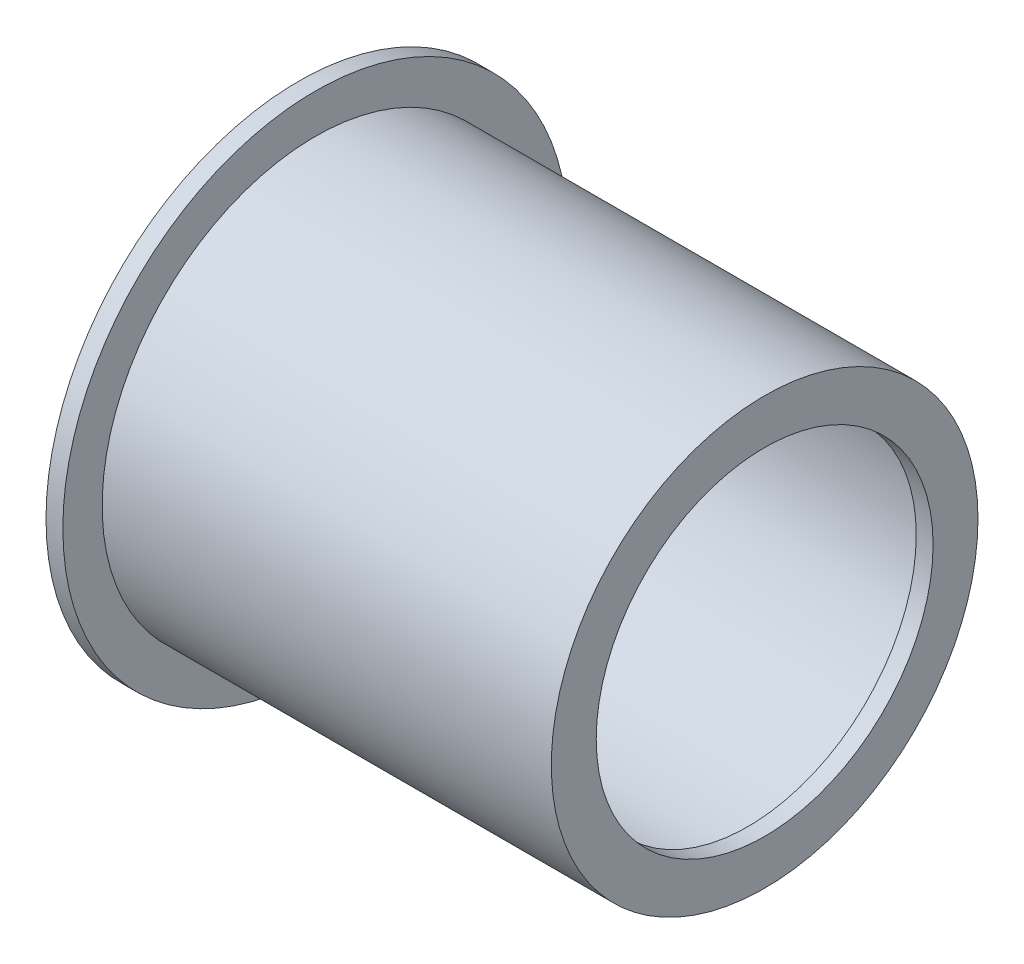
ISO-10303-21;
HEADER;
FILE_DESCRIPTION(('STEP AP214'),'2;1');
FILE_NAME('part.step','',(''),(''),'','','');
FILE_SCHEMA(('AUTOMOTIVE_DESIGN { 1 0 10303 214 1 1 1 1 }'));
ENDSEC;
DATA;
#1=APPLICATION_CONTEXT('core data for automotive mechanical design processes');
#2=APPLICATION_PROTOCOL_DEFINITION('international standard','automotive_design',2000,#1);
#3=PRODUCT_CONTEXT('',#1,'mechanical');
#4=PRODUCT('Part','Part','',(#3));
#5=PRODUCT_RELATED_PRODUCT_CATEGORY('part','',(#4));
#6=PRODUCT_DEFINITION_FORMATION('','',#4);
#7=PRODUCT_DEFINITION_CONTEXT('part definition',#1,'design');
#8=PRODUCT_DEFINITION('design','',#6,#7);
#9=PRODUCT_DEFINITION_SHAPE('','',#8);
#10=(LENGTH_UNIT() NAMED_UNIT(*) SI_UNIT(.MILLI.,.METRE.));
#11=(NAMED_UNIT(*) PLANE_ANGLE_UNIT() SI_UNIT($,.RADIAN.));
#12=(NAMED_UNIT(*) SI_UNIT($,.STERADIAN.) SOLID_ANGLE_UNIT());
#13=UNCERTAINTY_MEASURE_WITH_UNIT(LENGTH_MEASURE(1.E-05),#10,'distance_accuracy_value','');
#14=(GEOMETRIC_REPRESENTATION_CONTEXT(3) GLOBAL_UNCERTAINTY_ASSIGNED_CONTEXT((#13)) GLOBAL_UNIT_ASSIGNED_CONTEXT((#10,
#11,#12)) REPRESENTATION_CONTEXT('',''));
#15=CARTESIAN_POINT('',(0.,0.,0.));
#16=DIRECTION('',(0.,0.,1.));
#17=DIRECTION('',(1.,0.,0.));
#18=AXIS2_PLACEMENT_3D('',#15,#16,#17);
#19=CARTESIAN_POINT('',(0.,0.,0.));
#20=DIRECTION('',(1.,0.,0.));
#21=DIRECTION('',(0.,0.,-1.));
#22=AXIS2_PLACEMENT_3D('',#19,#20,#21);
#23=CYLINDRICAL_SURFACE('',#22,35.);
#24=CARTESIAN_POINT('',(0.,0.,0.));
#25=DIRECTION('',(1.,0.,0.));
#26=DIRECTION('',(0.,0.,-1.));
#27=AXIS2_PLACEMENT_3D('',#24,#25,#26);
#28=CIRCLE('',#27,35.);
#29=CARTESIAN_POINT('',(0.,0.,-35.));
#30=VERTEX_POINT('',#29);
#31=EDGE_CURVE('E10',#30,#30,#28,.T.);
#32=ORIENTED_EDGE('',*,*,#31,.T.);
#33=EDGE_LOOP('',(#32));
#34=FACE_BOUND('',#33,.T.);
#35=CARTESIAN_POINT('',(-77.,0.,0.));
#36=DIRECTION('',(-1.,0.,0.));
#37=DIRECTION('',(0.,0.,1.));
#38=AXIS2_PLACEMENT_3D('',#35,#36,#37);
#39=CIRCLE('',#38,35.);
#40=CARTESIAN_POINT('',(-77.,0.,35.));
#41=VERTEX_POINT('',#40);
#42=EDGE_CURVE('E61',#41,#41,#39,.T.);
#43=ORIENTED_EDGE('',*,*,#42,.T.);
#44=EDGE_LOOP('',(#43));
#45=FACE_BOUND('',#44,.T.);
#46=ADVANCED_FACE('F32',(#34,#45),#23,.F.);
#47=CARTESIAN_POINT('',(0.,35.,0.));
#48=DIRECTION('',(-1.,0.,0.));
#49=DIRECTION('',(0.,0.,1.));
#50=AXIS2_PLACEMENT_3D('',#47,#48,#49);
#51=PLANE('',#50);
#52=CARTESIAN_POINT('',(0.,0.,0.));
#53=DIRECTION('',(1.,0.,0.));
#54=DIRECTION('',(0.,0.,-1.));
#55=AXIS2_PLACEMENT_3D('',#52,#53,#54);
#56=CIRCLE('',#55,30.);
#57=CARTESIAN_POINT('',(0.,0.,-30.));
#58=VERTEX_POINT('',#57);
#59=EDGE_CURVE('E58',#58,#58,#56,.T.);
#60=ORIENTED_EDGE('',*,*,#59,.T.);
#61=EDGE_LOOP('',(#60));
#62=FACE_BOUND('',#61,.T.);
#63=ORIENTED_EDGE('',*,*,#31,.F.);
#64=EDGE_LOOP('',(#63));
#65=FACE_BOUND('',#64,.T.);
#66=ADVANCED_FACE('F34',(#62,#65),#51,.T.);
#67=CARTESIAN_POINT('',(-80.,45.,0.));
#68=DIRECTION('',(-1.,0.,0.));
#69=DIRECTION('',(0.,0.,1.));
#70=AXIS2_PLACEMENT_3D('',#67,#68,#69);
#71=PLANE('',#70);
#72=CARTESIAN_POINT('',(-80.,0.,0.));
#73=DIRECTION('',(1.,0.,0.));
#74=DIRECTION('',(0.,0.,-1.));
#75=AXIS2_PLACEMENT_3D('',#72,#73,#74);
#76=CIRCLE('',#75,45.);
#77=CARTESIAN_POINT('',(-80.,0.,-45.));
#78=VERTEX_POINT('',#77);
#79=EDGE_CURVE('E39',#78,#78,#76,.T.);
#80=ORIENTED_EDGE('',*,*,#79,.F.);
#81=EDGE_LOOP('',(#80));
#82=FACE_BOUND('',#81,.T.);
#83=ADVANCED_FACE('F80',(#82),#71,.T.);
#84=CARTESIAN_POINT('',(0.,0.,0.));
#85=DIRECTION('',(1.,0.,0.));
#86=DIRECTION('',(0.,0.,-1.));
#87=AXIS2_PLACEMENT_3D('',#84,#85,#86);
#88=CYLINDRICAL_SURFACE('',#87,45.);
#89=CARTESIAN_POINT('',(-77.,0.,0.));
#90=DIRECTION('',(1.,0.,0.));
#91=DIRECTION('',(0.,0.,-1.));
#92=AXIS2_PLACEMENT_3D('',#89,#90,#91);
#93=CIRCLE('',#92,45.);
#94=CARTESIAN_POINT('',(-77.,0.,-45.));
#95=VERTEX_POINT('',#94);
#96=EDGE_CURVE('E43',#95,#95,#93,.T.);
#97=ORIENTED_EDGE('',*,*,#96,.F.);
#98=EDGE_LOOP('',(#97));
#99=FACE_BOUND('',#98,.T.);
#100=ORIENTED_EDGE('',*,*,#79,.T.);
#101=EDGE_LOOP('',(#100));
#102=FACE_BOUND('',#101,.T.);
#103=ADVANCED_FACE('F85',(#99,#102),#88,.T.);
#104=CARTESIAN_POINT('',(-77.,45.,0.));
#105=DIRECTION('',(-1.,0.,0.));
#106=DIRECTION('',(0.,0.,1.));
#107=AXIS2_PLACEMENT_3D('',#104,#105,#106);
#108=PLANE('',#107);
#109=CARTESIAN_POINT('',(-77.,0.,0.));
#110=DIRECTION('',(1.,0.,0.));
#111=DIRECTION('',(0.,0.,-1.));
#112=AXIS2_PLACEMENT_3D('',#109,#110,#111);
#113=CIRCLE('',#112,38.);
#114=CARTESIAN_POINT('',(-77.,0.,-38.));
#115=VERTEX_POINT('',#114);
#116=EDGE_CURVE('E47',#115,#115,#113,.T.);
#117=ORIENTED_EDGE('',*,*,#116,.F.);
#118=EDGE_LOOP('',(#117));
#119=FACE_BOUND('',#118,.T.);
#120=ORIENTED_EDGE('',*,*,#96,.T.);
#121=EDGE_LOOP('',(#120));
#122=FACE_BOUND('',#121,.T.);
#123=ADVANCED_FACE('F89',(#119,#122),#108,.F.);
#124=CARTESIAN_POINT('',(0.,0.,0.));
#125=DIRECTION('',(1.,0.,0.));
#126=DIRECTION('',(0.,0.,-1.));
#127=AXIS2_PLACEMENT_3D('',#124,#125,#126);
#128=CYLINDRICAL_SURFACE('',#127,38.);
#129=CARTESIAN_POINT('',(3.,0.,0.));
#130=DIRECTION('',(1.,0.,0.));
#131=DIRECTION('',(0.,0.,-1.));
#132=AXIS2_PLACEMENT_3D('',#129,#130,#131);
#133=CIRCLE('',#132,38.);
#134=CARTESIAN_POINT('',(3.,0.,-38.));
#135=VERTEX_POINT('',#134);
#136=EDGE_CURVE('E52',#135,#135,#133,.T.);
#137=ORIENTED_EDGE('',*,*,#136,.F.);
#138=EDGE_LOOP('',(#137));
#139=FACE_BOUND('',#138,.T.);
#140=ORIENTED_EDGE('',*,*,#116,.T.);
#141=EDGE_LOOP('',(#140));
#142=FACE_BOUND('',#141,.T.);
#143=ADVANCED_FACE('F93',(#139,#142),#128,.T.);
#144=CARTESIAN_POINT('',(3.,35.,0.));
#145=DIRECTION('',(-1.,0.,0.));
#146=DIRECTION('',(0.,0.,1.));
#147=AXIS2_PLACEMENT_3D('',#144,#145,#146);
#148=PLANE('',#147);
#149=CARTESIAN_POINT('',(3.,0.,0.));
#150=DIRECTION('',(1.,0.,0.));
#151=DIRECTION('',(0.,0.,-1.));
#152=AXIS2_PLACEMENT_3D('',#149,#150,#151);
#153=CIRCLE('',#152,30.);
#154=CARTESIAN_POINT('',(3.,0.,-30.));
#155=VERTEX_POINT('',#154);
#156=EDGE_CURVE('E55',#155,#155,#153,.T.);
#157=ORIENTED_EDGE('',*,*,#156,.F.);
#158=EDGE_LOOP('',(#157));
#159=FACE_BOUND('',#158,.T.);
#160=ORIENTED_EDGE('',*,*,#136,.T.);
#161=EDGE_LOOP('',(#160));
#162=FACE_BOUND('',#161,.T.);
#163=ADVANCED_FACE('F73',(#159,#162),#148,.F.);
#164=CARTESIAN_POINT('',(0.,0.,0.));
#165=DIRECTION('',(1.,0.,0.));
#166=DIRECTION('',(0.,0.,-1.));
#167=AXIS2_PLACEMENT_3D('',#164,#165,#166);
#168=CYLINDRICAL_SURFACE('',#167,30.);
#169=ORIENTED_EDGE('',*,*,#59,.F.);
#170=EDGE_LOOP('',(#169));
#171=FACE_BOUND('',#170,.T.);
#172=ORIENTED_EDGE('',*,*,#156,.T.);
#173=EDGE_LOOP('',(#172));
#174=FACE_BOUND('',#173,.T.);
#175=ADVANCED_FACE('F68',(#171,#174),#168,.F.);
#176=CARTESIAN_POINT('',(-77.,0.,0.));
#177=DIRECTION('',(-1.,0.,0.));
#178=DIRECTION('',(0.,0.,1.));
#179=AXIS2_PLACEMENT_3D('',#176,#177,#178);
#180=PLANE('',#179);
#181=ORIENTED_EDGE('',*,*,#42,.F.);
#182=EDGE_LOOP('',(#181));
#183=FACE_BOUND('',#182,.T.);
#184=ADVANCED_FACE('F66',(#183),#180,.F.);
#185=CLOSED_SHELL('',(#46,#66,#83,#103,#123,#143,#163,#175,#184));
#186=MANIFOLD_SOLID_BREP('B2',#185);
#187=ADVANCED_BREP_SHAPE_REPRESENTATION('',(#18,#186),#14);
#188=SHAPE_DEFINITION_REPRESENTATION(#9,#187);
ENDSEC;
END-ISO-10303-21;
